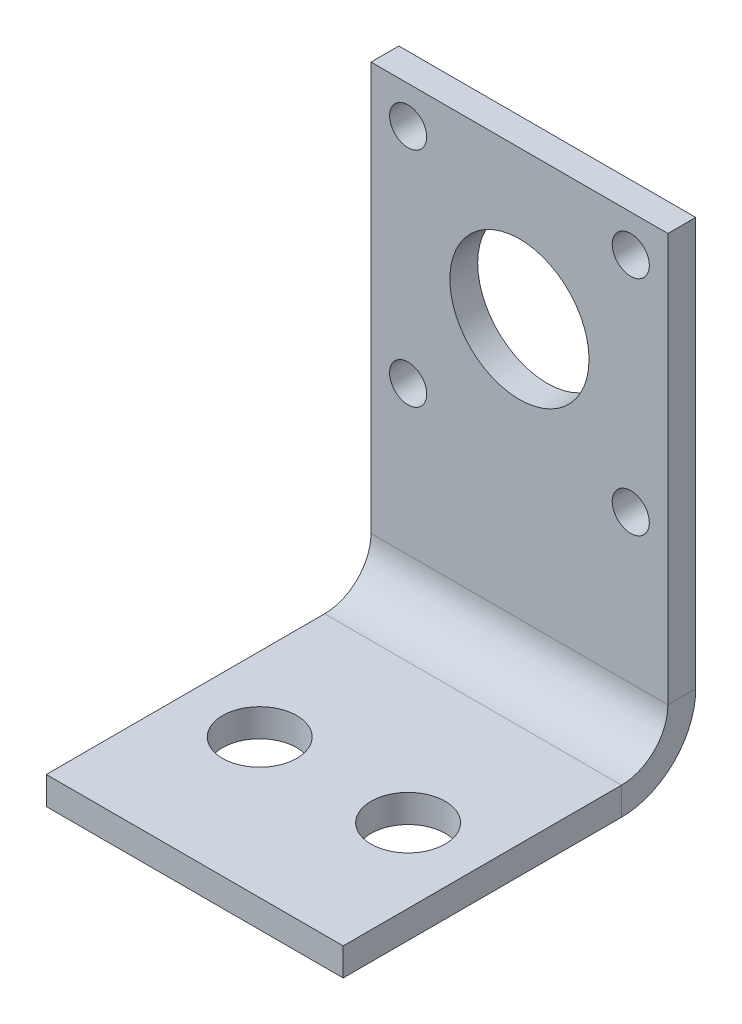
ISO-10303-21;
HEADER;
FILE_DESCRIPTION(('STEP AP214'),'2;1');
FILE_NAME('part.step','',(''),(''),'','','');
FILE_SCHEMA(('AUTOMOTIVE_DESIGN { 1 0 10303 214 1 1 1 1 }'));
ENDSEC;
DATA;
#1=APPLICATION_CONTEXT('core data for automotive mechanical design processes');
#2=APPLICATION_PROTOCOL_DEFINITION('international standard','automotive_design',2000,#1);
#3=PRODUCT_CONTEXT('',#1,'mechanical');
#4=PRODUCT('Part','Part','',(#3));
#5=PRODUCT_RELATED_PRODUCT_CATEGORY('part','',(#4));
#6=PRODUCT_DEFINITION_FORMATION('','',#4);
#7=PRODUCT_DEFINITION_CONTEXT('part definition',#1,'design');
#8=PRODUCT_DEFINITION('design','',#6,#7);
#9=PRODUCT_DEFINITION_SHAPE('','',#8);
#10=(LENGTH_UNIT() NAMED_UNIT(*) SI_UNIT(.MILLI.,.METRE.));
#11=(NAMED_UNIT(*) PLANE_ANGLE_UNIT() SI_UNIT($,.RADIAN.));
#12=(NAMED_UNIT(*) SI_UNIT($,.STERADIAN.) SOLID_ANGLE_UNIT());
#13=UNCERTAINTY_MEASURE_WITH_UNIT(LENGTH_MEASURE(1.E-05),#10,'distance_accuracy_value','');
#14=(GEOMETRIC_REPRESENTATION_CONTEXT(3) GLOBAL_UNCERTAINTY_ASSIGNED_CONTEXT((#13)) GLOBAL_UNIT_ASSIGNED_CONTEXT((#10,
#11,#12)) REPRESENTATION_CONTEXT('',''));
#15=CARTESIAN_POINT('',(0.,0.,0.));
#16=DIRECTION('',(0.,0.,1.));
#17=DIRECTION('',(1.,0.,0.));
#18=AXIS2_PLACEMENT_3D('',#15,#16,#17);
#19=CARTESIAN_POINT('',(16.,3.,15.));
#20=DIRECTION('',(-1.,0.,0.));
#21=DIRECTION('',(0.,0.,1.));
#22=AXIS2_PLACEMENT_3D('',#19,#20,#21);
#23=PLANE('',#22);
#24=DIRECTION('',(0.,0.,-1.));
#25=VECTOR('',#24,1.);
#26=CARTESIAN_POINT('',(16.,0.,15.));
#27=LINE('',#26,#25);
#28=CARTESIAN_POINT('',(16.,0.,15.));
#29=VERTEX_POINT('',#28);
#30=CARTESIAN_POINT('',(16.,0.,-15.));
#31=VERTEX_POINT('',#30);
#32=EDGE_CURVE('E178',#29,#31,#27,.T.);
#33=ORIENTED_EDGE('',*,*,#32,.T.);
#34=DIRECTION('',(0.,-1.,0.));
#35=VECTOR('',#34,1.);
#36=CARTESIAN_POINT('',(16.,3.,-15.));
#37=LINE('',#36,#35);
#38=CARTESIAN_POINT('',(16.,3.,-15.));
#39=VERTEX_POINT('',#38);
#40=EDGE_CURVE('E13',#39,#31,#37,.T.);
#41=ORIENTED_EDGE('',*,*,#40,.F.);
#42=DIRECTION('',(0.,0.,-1.));
#43=VECTOR('',#42,1.);
#44=CARTESIAN_POINT('',(16.,3.,15.));
#45=LINE('',#44,#43);
#46=CARTESIAN_POINT('',(16.,3.,15.));
#47=VERTEX_POINT('',#46);
#48=EDGE_CURVE('E103',#47,#39,#45,.T.);
#49=ORIENTED_EDGE('',*,*,#48,.F.);
#50=DIRECTION('',(0.,-1.,0.));
#51=VECTOR('',#50,1.);
#52=CARTESIAN_POINT('',(16.,3.,15.));
#53=LINE('',#52,#51);
#54=EDGE_CURVE('E194',#47,#29,#53,.T.);
#55=ORIENTED_EDGE('',*,*,#54,.T.);
#56=EDGE_LOOP('',(#33,#41,#49,#55));
#57=FACE_BOUND('',#56,.T.);
#58=ADVANCED_FACE('F59',(#57),#23,.F.);
#59=CARTESIAN_POINT('',(-16.,3.,15.));
#60=DIRECTION('',(1.,0.,0.));
#61=DIRECTION('',(0.,0.,-1.));
#62=AXIS2_PLACEMENT_3D('',#59,#60,#61);
#63=PLANE('',#62);
#64=DIRECTION('',(0.,0.,1.));
#65=VECTOR('',#64,1.);
#66=CARTESIAN_POINT('',(-16.,0.,15.));
#67=LINE('',#66,#65);
#68=CARTESIAN_POINT('',(-16.,0.,-15.));
#69=VERTEX_POINT('',#68);
#70=CARTESIAN_POINT('',(-16.,0.,15.));
#71=VERTEX_POINT('',#70);
#72=EDGE_CURVE('E92',#69,#71,#67,.T.);
#73=ORIENTED_EDGE('',*,*,#72,.T.);
#74=DIRECTION('',(0.,-1.,0.));
#75=VECTOR('',#74,1.);
#76=CARTESIAN_POINT('',(-16.,3.,15.));
#77=LINE('',#76,#75);
#78=CARTESIAN_POINT('',(-16.,3.,15.));
#79=VERTEX_POINT('',#78);
#80=EDGE_CURVE('E203',#79,#71,#77,.T.);
#81=ORIENTED_EDGE('',*,*,#80,.F.);
#82=DIRECTION('',(0.,0.,1.));
#83=VECTOR('',#82,1.);
#84=CARTESIAN_POINT('',(-16.,3.,15.));
#85=LINE('',#84,#83);
#86=CARTESIAN_POINT('',(-16.,3.,-15.));
#87=VERTEX_POINT('',#86);
#88=EDGE_CURVE('E191',#87,#79,#85,.T.);
#89=ORIENTED_EDGE('',*,*,#88,.F.);
#90=DIRECTION('',(0.,-1.,0.));
#91=VECTOR('',#90,1.);
#92=CARTESIAN_POINT('',(-16.,3.,-15.));
#93=LINE('',#92,#91);
#94=EDGE_CURVE('E68',#87,#69,#93,.T.);
#95=ORIENTED_EDGE('',*,*,#94,.T.);
#96=EDGE_LOOP('',(#73,#81,#89,#95));
#97=FACE_BOUND('',#96,.T.);
#98=ADVANCED_FACE('F248',(#97),#63,.F.);
#99=CARTESIAN_POINT('',(-16.,3.,15.));
#100=DIRECTION('',(0.,0.,-1.));
#101=DIRECTION('',(-1.,0.,0.));
#102=AXIS2_PLACEMENT_3D('',#99,#100,#101);
#103=PLANE('',#102);
#104=DIRECTION('',(1.,0.,0.));
#105=VECTOR('',#104,1.);
#106=CARTESIAN_POINT('',(-16.,0.,15.));
#107=LINE('',#106,#105);
#108=EDGE_CURVE('E98',#71,#29,#107,.T.);
#109=ORIENTED_EDGE('',*,*,#108,.T.);
#110=ORIENTED_EDGE('',*,*,#54,.F.);
#111=DIRECTION('',(1.,0.,0.));
#112=VECTOR('',#111,1.);
#113=CARTESIAN_POINT('',(-16.,3.,15.));
#114=LINE('',#113,#112);
#115=EDGE_CURVE('E77',#79,#47,#114,.T.);
#116=ORIENTED_EDGE('',*,*,#115,.F.);
#117=ORIENTED_EDGE('',*,*,#80,.T.);
#118=EDGE_LOOP('',(#109,#110,#116,#117));
#119=FACE_BOUND('',#118,.T.);
#120=ADVANCED_FACE('F253',(#119),#103,.F.);
#121=CARTESIAN_POINT('',(0.,3.,0.));
#122=DIRECTION('',(0.,-1.,0.));
#123=DIRECTION('',(0.,0.,-1.));
#124=AXIS2_PLACEMENT_3D('',#121,#122,#123);
#125=PLANE('',#124);
#126=CARTESIAN_POINT('',(-8.,3.,0.));
#127=DIRECTION('',(0.,1.,0.));
#128=DIRECTION('',(0.,0.,1.));
#129=AXIS2_PLACEMENT_3D('',#126,#127,#128);
#130=CIRCLE('',#129,4.);
#131=CARTESIAN_POINT('',(-8.,3.,4.));
#132=VERTEX_POINT('',#131);
#133=EDGE_CURVE('E207',#132,#132,#130,.T.);
#134=ORIENTED_EDGE('',*,*,#133,.F.);
#135=EDGE_LOOP('',(#134));
#136=FACE_BOUND('',#135,.T.);
#137=CARTESIAN_POINT('',(8.,3.,0.));
#138=DIRECTION('',(0.,1.,0.));
#139=DIRECTION('',(0.,0.,1.));
#140=AXIS2_PLACEMENT_3D('',#137,#138,#139);
#141=CIRCLE('',#140,4.);
#142=CARTESIAN_POINT('',(8.,3.,4.));
#143=VERTEX_POINT('',#142);
#144=EDGE_CURVE('E212',#143,#143,#141,.T.);
#145=ORIENTED_EDGE('',*,*,#144,.F.);
#146=EDGE_LOOP('',(#145));
#147=FACE_BOUND('',#146,.T.);
#148=ORIENTED_EDGE('',*,*,#48,.T.);
#149=DIRECTION('',(-1.,0.,0.));
#150=VECTOR('',#149,1.);
#151=CARTESIAN_POINT('',(-16.,3.,-15.));
#152=LINE('',#151,#150);
#153=EDGE_CURVE('E189',#39,#87,#152,.T.);
#154=ORIENTED_EDGE('',*,*,#153,.T.);
#155=ORIENTED_EDGE('',*,*,#88,.T.);
#156=ORIENTED_EDGE('',*,*,#115,.T.);
#157=EDGE_LOOP('',(#148,#154,#155,#156));
#158=FACE_BOUND('',#157,.T.);
#159=ADVANCED_FACE('F262',(#136,#147,#158),#125,.F.);
#160=CARTESIAN_POINT('',(0.,0.,0.));
#161=DIRECTION('',(0.,-1.,0.));
#162=DIRECTION('',(0.,0.,-1.));
#163=AXIS2_PLACEMENT_3D('',#160,#161,#162);
#164=PLANE('',#163);
#165=CARTESIAN_POINT('',(-8.,0.,0.));
#166=DIRECTION('',(0.,-1.,0.));
#167=DIRECTION('',(0.,0.,-1.));
#168=AXIS2_PLACEMENT_3D('',#165,#166,#167);
#169=CIRCLE('',#168,4.);
#170=CARTESIAN_POINT('',(-8.,0.,-4.));
#171=VERTEX_POINT('',#170);
#172=EDGE_CURVE('E62',#171,#171,#169,.T.);
#173=ORIENTED_EDGE('',*,*,#172,.F.);
#174=EDGE_LOOP('',(#173));
#175=FACE_BOUND('',#174,.T.);
#176=CARTESIAN_POINT('',(8.,0.,0.));
#177=DIRECTION('',(0.,-1.,0.));
#178=DIRECTION('',(0.,0.,-1.));
#179=AXIS2_PLACEMENT_3D('',#176,#177,#178);
#180=CIRCLE('',#179,4.);
#181=CARTESIAN_POINT('',(8.,0.,-4.));
#182=VERTEX_POINT('',#181);
#183=EDGE_CURVE('E205',#182,#182,#180,.T.);
#184=ORIENTED_EDGE('',*,*,#183,.F.);
#185=EDGE_LOOP('',(#184));
#186=FACE_BOUND('',#185,.T.);
#187=ORIENTED_EDGE('',*,*,#32,.F.);
#188=ORIENTED_EDGE('',*,*,#108,.F.);
#189=ORIENTED_EDGE('',*,*,#72,.F.);
#190=DIRECTION('',(-1.,0.,0.));
#191=VECTOR('',#190,1.);
#192=CARTESIAN_POINT('',(-16.,0.,-15.));
#193=LINE('',#192,#191);
#194=EDGE_CURVE('E197',#31,#69,#193,.T.);
#195=ORIENTED_EDGE('',*,*,#194,.F.);
#196=EDGE_LOOP('',(#187,#188,#189,#195));
#197=FACE_BOUND('',#196,.T.);
#198=ADVANCED_FACE('F260',(#175,#186,#197),#164,.T.);
#199=CARTESIAN_POINT('',(16.,7.99999999999995,-15.));
#200=DIRECTION('',(1.,0.,0.));
#201=DIRECTION('',(0.,0.,-1.));
#202=AXIS2_PLACEMENT_3D('',#199,#200,#201);
#203=PLANE('',#202);
#204=DIRECTION('',(0.,0.,1.));
#205=VECTOR('',#204,1.);
#206=CARTESIAN_POINT('',(16.,8.,-22.9999999999999));
#207=LINE('',#206,#205);
#208=CARTESIAN_POINT('',(16.,7.99999999999993,-20.));
#209=VERTEX_POINT('',#208);
#210=CARTESIAN_POINT('',(16.,7.99999999999992,-23.));
#211=VERTEX_POINT('',#210);
#212=EDGE_CURVE('E157',#209,#211,#207,.F.);
#213=ORIENTED_EDGE('',*,*,#212,.F.);
#214=CARTESIAN_POINT('',(16.,7.99999999999995,-15.));
#215=DIRECTION('',(-1.,0.,0.));
#216=DIRECTION('',(0.,0.,1.));
#217=AXIS2_PLACEMENT_3D('',#214,#215,#216);
#218=CIRCLE('',#217,5.);
#219=EDGE_CURVE('E182',#39,#209,#218,.F.);
#220=ORIENTED_EDGE('',*,*,#219,.F.);
#221=ORIENTED_EDGE('',*,*,#40,.T.);
#222=CARTESIAN_POINT('',(16.,7.99999999999995,-15.));
#223=DIRECTION('',(-1.,0.,0.));
#224=DIRECTION('',(0.,0.,1.));
#225=AXIS2_PLACEMENT_3D('',#222,#223,#224);
#226=CIRCLE('',#225,8.);
#227=EDGE_CURVE('E175',#31,#211,#226,.F.);
#228=ORIENTED_EDGE('',*,*,#227,.T.);
#229=EDGE_LOOP('',(#213,#220,#221,#228));
#230=FACE_BOUND('',#229,.T.);
#231=ADVANCED_FACE('F258',(#230),#203,.T.);
#232=CARTESIAN_POINT('',(-16.,7.99999999999995,-15.));
#233=DIRECTION('',(1.,0.,0.));
#234=DIRECTION('',(0.,0.,-1.));
#235=AXIS2_PLACEMENT_3D('',#232,#233,#234);
#236=PLANE('',#235);
#237=CARTESIAN_POINT('',(-16.,7.99999999999995,-15.));
#238=DIRECTION('',(-1.,0.,0.));
#239=DIRECTION('',(0.,0.,1.));
#240=AXIS2_PLACEMENT_3D('',#237,#238,#239);
#241=CIRCLE('',#240,5.);
#242=CARTESIAN_POINT('',(-16.,7.99999999999993,-20.));
#243=VERTEX_POINT('',#242);
#244=EDGE_CURVE('E185',#243,#87,#241,.T.);
#245=ORIENTED_EDGE('',*,*,#244,.F.);
#246=DIRECTION('',(0.,0.,1.));
#247=VECTOR('',#246,1.);
#248=CARTESIAN_POINT('',(-16.,7.99999999999998,-20.));
#249=LINE('',#248,#247);
#250=CARTESIAN_POINT('',(-16.,8.,-23.));
#251=VERTEX_POINT('',#250);
#252=EDGE_CURVE('E169',#243,#251,#249,.F.);
#253=ORIENTED_EDGE('',*,*,#252,.T.);
#254=CARTESIAN_POINT('',(-16.,7.99999999999995,-15.));
#255=DIRECTION('',(-1.,0.,0.));
#256=DIRECTION('',(0.,0.,1.));
#257=AXIS2_PLACEMENT_3D('',#254,#255,#256);
#258=CIRCLE('',#257,8.);
#259=EDGE_CURVE('E179',#251,#69,#258,.T.);
#260=ORIENTED_EDGE('',*,*,#259,.T.);
#261=ORIENTED_EDGE('',*,*,#94,.F.);
#262=EDGE_LOOP('',(#245,#253,#260,#261));
#263=FACE_BOUND('',#262,.T.);
#264=ADVANCED_FACE('F234',(#263),#236,.F.);
#265=CARTESIAN_POINT('',(-16.,7.99999999999995,-15.));
#266=DIRECTION('',(-1.,0.,0.));
#267=DIRECTION('',(0.,0.,-1.));
#268=AXIS2_PLACEMENT_3D('',#265,#266,#267);
#269=CYLINDRICAL_SURFACE('',#268,8.);
#270=ORIENTED_EDGE('',*,*,#194,.T.);
#271=ORIENTED_EDGE('',*,*,#259,.F.);
#272=DIRECTION('',(-1.,0.,0.));
#273=VECTOR('',#272,1.);
#274=CARTESIAN_POINT('',(16.,8.,-23.));
#275=LINE('',#274,#273);
#276=EDGE_CURVE('E167',#251,#211,#275,.F.);
#277=ORIENTED_EDGE('',*,*,#276,.T.);
#278=ORIENTED_EDGE('',*,*,#227,.F.);
#279=EDGE_LOOP('',(#270,#271,#277,#278));
#280=FACE_BOUND('',#279,.T.);
#281=ADVANCED_FACE('F243',(#280),#269,.T.);
#282=CARTESIAN_POINT('',(-16.,7.99999999999995,-15.));
#283=DIRECTION('',(-1.,0.,0.));
#284=DIRECTION('',(0.,0.,-1.));
#285=AXIS2_PLACEMENT_3D('',#282,#283,#284);
#286=CYLINDRICAL_SURFACE('',#285,5.);
#287=ORIENTED_EDGE('',*,*,#153,.F.);
#288=ORIENTED_EDGE('',*,*,#219,.T.);
#289=DIRECTION('',(-1.,0.,0.));
#290=VECTOR('',#289,1.);
#291=CARTESIAN_POINT('',(16.,7.99999999999998,-20.));
#292=LINE('',#291,#290);
#293=EDGE_CURVE('E172',#209,#243,#292,.T.);
#294=ORIENTED_EDGE('',*,*,#293,.T.);
#295=ORIENTED_EDGE('',*,*,#244,.T.);
#296=EDGE_LOOP('',(#287,#288,#294,#295));
#297=FACE_BOUND('',#296,.T.);
#298=ADVANCED_FACE('F229',(#297),#286,.F.);
#299=CARTESIAN_POINT('',(-16.,52.,-23.0000000000002));
#300=DIRECTION('',(1.,0.,0.));
#301=DIRECTION('',(0.,0.,-1.));
#302=AXIS2_PLACEMENT_3D('',#299,#300,#301);
#303=PLANE('',#302);
#304=ORIENTED_EDGE('',*,*,#252,.F.);
#305=DIRECTION('',(0.,-1.,0.));
#306=VECTOR('',#305,1.);
#307=CARTESIAN_POINT('',(-16.,52.,-20.0000000000002));
#308=LINE('',#307,#306);
#309=CARTESIAN_POINT('',(-16.,52.,-20.0000000000002));
#310=VERTEX_POINT('',#309);
#311=EDGE_CURVE('E165',#243,#310,#308,.F.);
#312=ORIENTED_EDGE('',*,*,#311,.T.);
#313=DIRECTION('',(0.,0.,1.));
#314=VECTOR('',#313,1.);
#315=CARTESIAN_POINT('',(-16.,52.,-23.0000000000002));
#316=LINE('',#315,#314);
#317=CARTESIAN_POINT('',(-16.,52.,-23.0000000000002));
#318=VERTEX_POINT('',#317);
#319=EDGE_CURVE('E153',#318,#310,#316,.T.);
#320=ORIENTED_EDGE('',*,*,#319,.F.);
#321=DIRECTION('',(0.,1.,0.));
#322=VECTOR('',#321,1.);
#323=CARTESIAN_POINT('',(-16.,0.,-23.));
#324=LINE('',#323,#322);
#325=EDGE_CURVE('E140',#251,#318,#324,.T.);
#326=ORIENTED_EDGE('',*,*,#325,.F.);
#327=EDGE_LOOP('',(#304,#312,#320,#326));
#328=FACE_BOUND('',#327,.T.);
#329=ADVANCED_FACE('F235',(#328),#303,.F.);
#330=CARTESIAN_POINT('',(16.,2.99999999999999,-23.));
#331=DIRECTION('',(-1.,0.,0.));
#332=DIRECTION('',(0.,0.,1.));
#333=AXIS2_PLACEMENT_3D('',#330,#331,#332);
#334=PLANE('',#333);
#335=ORIENTED_EDGE('',*,*,#212,.T.);
#336=DIRECTION('',(0.,-1.,0.));
#337=VECTOR('',#336,1.);
#338=CARTESIAN_POINT('',(16.,0.,-23.));
#339=LINE('',#338,#337);
#340=CARTESIAN_POINT('',(16.,52.,-23.0000000000002));
#341=VERTEX_POINT('',#340);
#342=EDGE_CURVE('E138',#341,#211,#339,.T.);
#343=ORIENTED_EDGE('',*,*,#342,.F.);
#344=DIRECTION('',(0.,0.,1.));
#345=VECTOR('',#344,1.);
#346=CARTESIAN_POINT('',(16.,52.,-23.0000000000002));
#347=LINE('',#346,#345);
#348=CARTESIAN_POINT('',(16.,52.,-20.0000000000002));
#349=VERTEX_POINT('',#348);
#350=EDGE_CURVE('E146',#341,#349,#347,.T.);
#351=ORIENTED_EDGE('',*,*,#350,.T.);
#352=DIRECTION('',(0.,1.,0.));
#353=VECTOR('',#352,1.);
#354=CARTESIAN_POINT('',(16.,3.,-20.));
#355=LINE('',#354,#353);
#356=EDGE_CURVE('E162',#349,#209,#355,.F.);
#357=ORIENTED_EDGE('',*,*,#356,.T.);
#358=EDGE_LOOP('',(#335,#343,#351,#357));
#359=FACE_BOUND('',#358,.T.);
#360=ADVANCED_FACE('F156',(#359),#334,.F.);
#361=CARTESIAN_POINT('',(0.,0.,-23.));
#362=DIRECTION('',(0.,0.,1.));
#363=DIRECTION('',(0.,-1.,0.));
#364=AXIS2_PLACEMENT_3D('',#361,#362,#363);
#365=PLANE('',#364);
#366=CARTESIAN_POINT('',(-12.,24.,-23.0000000000001));
#367=DIRECTION('',(0.,0.,1.));
#368=DIRECTION('',(0.,-1.,0.));
#369=AXIS2_PLACEMENT_3D('',#366,#367,#368);
#370=CIRCLE('',#369,2.);
#371=CARTESIAN_POINT('',(-12.,22.,-23.));
#372=VERTEX_POINT('',#371);
#373=EDGE_CURVE('E217',#372,#372,#370,.T.);
#374=ORIENTED_EDGE('',*,*,#373,.T.);
#375=EDGE_LOOP('',(#374));
#376=FACE_BOUND('',#375,.T.);
#377=CARTESIAN_POINT('',(12.,24.,-23.0000000000001));
#378=DIRECTION('',(0.,0.,1.));
#379=DIRECTION('',(0.,-1.,0.));
#380=AXIS2_PLACEMENT_3D('',#377,#378,#379);
#381=CIRCLE('',#380,2.);
#382=CARTESIAN_POINT('',(12.,22.,-23.));
#383=VERTEX_POINT('',#382);
#384=EDGE_CURVE('E481',#383,#383,#381,.T.);
#385=ORIENTED_EDGE('',*,*,#384,.T.);
#386=EDGE_LOOP('',(#385));
#387=FACE_BOUND('',#386,.T.);
#388=CARTESIAN_POINT('',(12.,48.,-23.0000000000001));
#389=DIRECTION('',(0.,0.,1.));
#390=DIRECTION('',(0.,-1.,0.));
#391=AXIS2_PLACEMENT_3D('',#388,#389,#390);
#392=CIRCLE('',#391,2.);
#393=CARTESIAN_POINT('',(12.,46.,-23.0000000000001));
#394=VERTEX_POINT('',#393);
#395=EDGE_CURVE('E483',#394,#394,#392,.T.);
#396=ORIENTED_EDGE('',*,*,#395,.T.);
#397=EDGE_LOOP('',(#396));
#398=FACE_BOUND('',#397,.T.);
#399=CARTESIAN_POINT('',(-12.,48.,-23.0000000000001));
#400=DIRECTION('',(0.,0.,1.));
#401=DIRECTION('',(0.,-1.,0.));
#402=AXIS2_PLACEMENT_3D('',#399,#400,#401);
#403=CIRCLE('',#402,2.);
#404=CARTESIAN_POINT('',(-12.,46.,-23.0000000000001));
#405=VERTEX_POINT('',#404);
#406=EDGE_CURVE('E487',#405,#405,#403,.T.);
#407=ORIENTED_EDGE('',*,*,#406,.T.);
#408=EDGE_LOOP('',(#407));
#409=FACE_BOUND('',#408,.T.);
#410=CARTESIAN_POINT('',(0.,36.,-23.0000000000001));
#411=DIRECTION('',(0.,0.,1.));
#412=DIRECTION('',(0.,-1.,0.));
#413=AXIS2_PLACEMENT_3D('',#410,#411,#412);
#414=CIRCLE('',#413,7.5);
#415=CARTESIAN_POINT('',(0.,28.5,-23.0000000000001));
#416=VERTEX_POINT('',#415);
#417=EDGE_CURVE('E492',#416,#416,#414,.T.);
#418=ORIENTED_EDGE('',*,*,#417,.T.);
#419=EDGE_LOOP('',(#418));
#420=FACE_BOUND('',#419,.T.);
#421=ORIENTED_EDGE('',*,*,#276,.F.);
#422=ORIENTED_EDGE('',*,*,#325,.T.);
#423=DIRECTION('',(1.,0.,0.));
#424=VECTOR('',#423,1.);
#425=CARTESIAN_POINT('',(0.,52.,-23.0000000000002));
#426=LINE('',#425,#424);
#427=EDGE_CURVE('E133',#318,#341,#426,.T.);
#428=ORIENTED_EDGE('',*,*,#427,.T.);
#429=ORIENTED_EDGE('',*,*,#342,.T.);
#430=EDGE_LOOP('',(#421,#422,#428,#429));
#431=FACE_BOUND('',#430,.T.);
#432=ADVANCED_FACE('F136',(#376,#387,#398,#409,#420,#431),#365,.F.);
#433=CARTESIAN_POINT('',(0.,0.,-20.));
#434=DIRECTION('',(0.,0.,1.));
#435=DIRECTION('',(0.,-1.,0.));
#436=AXIS2_PLACEMENT_3D('',#433,#434,#435);
#437=PLANE('',#436);
#438=CARTESIAN_POINT('',(-12.,24.,-20.));
#439=DIRECTION('',(0.,0.,1.));
#440=DIRECTION('',(-1.,0.,0.));
#441=AXIS2_PLACEMENT_3D('',#438,#439,#440);
#442=CIRCLE('',#441,2.);
#443=CARTESIAN_POINT('',(-14.,24.,-20.));
#444=VERTEX_POINT('',#443);
#445=EDGE_CURVE('E478',#444,#444,#442,.T.);
#446=ORIENTED_EDGE('',*,*,#445,.F.);
#447=EDGE_LOOP('',(#446));
#448=FACE_BOUND('',#447,.T.);
#449=CARTESIAN_POINT('',(12.,24.,-20.));
#450=DIRECTION('',(0.,0.,1.));
#451=DIRECTION('',(1.,0.,0.));
#452=AXIS2_PLACEMENT_3D('',#449,#450,#451);
#453=CIRCLE('',#452,2.);
#454=CARTESIAN_POINT('',(14.,24.,-20.));
#455=VERTEX_POINT('',#454);
#456=EDGE_CURVE('E500',#455,#455,#453,.T.);
#457=ORIENTED_EDGE('',*,*,#456,.F.);
#458=EDGE_LOOP('',(#457));
#459=FACE_BOUND('',#458,.T.);
#460=CARTESIAN_POINT('',(12.,48.,-20.));
#461=DIRECTION('',(0.,0.,1.));
#462=DIRECTION('',(-1.,0.,0.));
#463=AXIS2_PLACEMENT_3D('',#460,#461,#462);
#464=CIRCLE('',#463,2.);
#465=CARTESIAN_POINT('',(10.,48.,-20.));
#466=VERTEX_POINT('',#465);
#467=EDGE_CURVE('E503',#466,#466,#464,.T.);
#468=ORIENTED_EDGE('',*,*,#467,.F.);
#469=EDGE_LOOP('',(#468));
#470=FACE_BOUND('',#469,.T.);
#471=CARTESIAN_POINT('',(-12.,48.,-20.));
#472=DIRECTION('',(0.,0.,1.));
#473=DIRECTION('',(1.,0.,0.));
#474=AXIS2_PLACEMENT_3D('',#471,#472,#473);
#475=CIRCLE('',#474,2.);
#476=CARTESIAN_POINT('',(-10.,48.,-20.));
#477=VERTEX_POINT('',#476);
#478=EDGE_CURVE('E498',#477,#477,#475,.T.);
#479=ORIENTED_EDGE('',*,*,#478,.F.);
#480=EDGE_LOOP('',(#479));
#481=FACE_BOUND('',#480,.T.);
#482=CARTESIAN_POINT('',(0.,36.,-20.));
#483=DIRECTION('',(0.,0.,1.));
#484=DIRECTION('',(1.,0.,0.));
#485=AXIS2_PLACEMENT_3D('',#482,#483,#484);
#486=CIRCLE('',#485,7.5);
#487=CARTESIAN_POINT('',(7.5,36.,-20.));
#488=VERTEX_POINT('',#487);
#489=EDGE_CURVE('E495',#488,#488,#486,.T.);
#490=ORIENTED_EDGE('',*,*,#489,.F.);
#491=EDGE_LOOP('',(#490));
#492=FACE_BOUND('',#491,.T.);
#493=ORIENTED_EDGE('',*,*,#311,.F.);
#494=ORIENTED_EDGE('',*,*,#293,.F.);
#495=ORIENTED_EDGE('',*,*,#356,.F.);
#496=DIRECTION('',(-1.,0.,0.));
#497=VECTOR('',#496,1.);
#498=CARTESIAN_POINT('',(16.,52.,-20.0000000000002));
#499=LINE('',#498,#497);
#500=EDGE_CURVE('E149',#310,#349,#499,.F.);
#501=ORIENTED_EDGE('',*,*,#500,.F.);
#502=EDGE_LOOP('',(#493,#494,#495,#501));
#503=FACE_BOUND('',#502,.T.);
#504=ADVANCED_FACE('F224',(#448,#459,#470,#481,#492,#503),#437,.T.);
#505=CARTESIAN_POINT('',(16.,52.,-23.0000000000002));
#506=DIRECTION('',(0.,-1.,0.));
#507=DIRECTION('',(0.,0.,-1.));
#508=AXIS2_PLACEMENT_3D('',#505,#506,#507);
#509=PLANE('',#508);
#510=ORIENTED_EDGE('',*,*,#500,.T.);
#511=ORIENTED_EDGE('',*,*,#350,.F.);
#512=ORIENTED_EDGE('',*,*,#427,.F.);
#513=ORIENTED_EDGE('',*,*,#319,.T.);
#514=EDGE_LOOP('',(#510,#511,#512,#513));
#515=FACE_BOUND('',#514,.T.);
#516=ADVANCED_FACE('F147',(#515),#509,.F.);
#517=CARTESIAN_POINT('',(8.,-7.,0.));
#518=DIRECTION('',(0.,1.,0.));
#519=DIRECTION('',(0.,0.,1.));
#520=AXIS2_PLACEMENT_3D('',#517,#518,#519);
#521=CYLINDRICAL_SURFACE('',#520,4.);
#522=ORIENTED_EDGE('',*,*,#183,.T.);
#523=EDGE_LOOP('',(#522));
#524=FACE_BOUND('',#523,.T.);
#525=ORIENTED_EDGE('',*,*,#144,.T.);
#526=EDGE_LOOP('',(#525));
#527=FACE_BOUND('',#526,.T.);
#528=ADVANCED_FACE('F310',(#524,#527),#521,.F.);
#529=CARTESIAN_POINT('',(-8.,-7.,0.));
#530=DIRECTION('',(0.,1.,0.));
#531=DIRECTION('',(0.,0.,1.));
#532=AXIS2_PLACEMENT_3D('',#529,#530,#531);
#533=CYLINDRICAL_SURFACE('',#532,4.);
#534=ORIENTED_EDGE('',*,*,#172,.T.);
#535=EDGE_LOOP('',(#534));
#536=FACE_BOUND('',#535,.T.);
#537=ORIENTED_EDGE('',*,*,#133,.T.);
#538=EDGE_LOOP('',(#537));
#539=FACE_BOUND('',#538,.T.);
#540=ADVANCED_FACE('F336',(#536,#539),#533,.F.);
#541=CARTESIAN_POINT('',(0.,36.,-30.));
#542=DIRECTION('',(0.,0.,1.));
#543=DIRECTION('',(1.,0.,0.));
#544=AXIS2_PLACEMENT_3D('',#541,#542,#543);
#545=CYLINDRICAL_SURFACE('',#544,7.5);
#546=ORIENTED_EDGE('',*,*,#489,.T.);
#547=EDGE_LOOP('',(#546));
#548=FACE_BOUND('',#547,.T.);
#549=ORIENTED_EDGE('',*,*,#417,.F.);
#550=EDGE_LOOP('',(#549));
#551=FACE_BOUND('',#550,.T.);
#552=ADVANCED_FACE('F346',(#548,#551),#545,.F.);
#553=CARTESIAN_POINT('',(-12.,48.,-30.));
#554=DIRECTION('',(0.,0.,1.));
#555=DIRECTION('',(1.,0.,0.));
#556=AXIS2_PLACEMENT_3D('',#553,#554,#555);
#557=CYLINDRICAL_SURFACE('',#556,2.);
#558=ORIENTED_EDGE('',*,*,#478,.T.);
#559=EDGE_LOOP('',(#558));
#560=FACE_BOUND('',#559,.T.);
#561=ORIENTED_EDGE('',*,*,#406,.F.);
#562=EDGE_LOOP('',(#561));
#563=FACE_BOUND('',#562,.T.);
#564=ADVANCED_FACE('F373',(#560,#563),#557,.F.);
#565=CARTESIAN_POINT('',(12.,48.,-30.));
#566=DIRECTION('',(0.,0.,1.));
#567=DIRECTION('',(1.,0.,0.));
#568=AXIS2_PLACEMENT_3D('',#565,#566,#567);
#569=CYLINDRICAL_SURFACE('',#568,2.);
#570=ORIENTED_EDGE('',*,*,#467,.T.);
#571=EDGE_LOOP('',(#570));
#572=FACE_BOUND('',#571,.T.);
#573=ORIENTED_EDGE('',*,*,#395,.F.);
#574=EDGE_LOOP('',(#573));
#575=FACE_BOUND('',#574,.T.);
#576=ADVANCED_FACE('F384',(#572,#575),#569,.F.);
#577=CARTESIAN_POINT('',(12.,24.,-30.));
#578=DIRECTION('',(0.,0.,1.));
#579=DIRECTION('',(1.,0.,0.));
#580=AXIS2_PLACEMENT_3D('',#577,#578,#579);
#581=CYLINDRICAL_SURFACE('',#580,2.);
#582=ORIENTED_EDGE('',*,*,#456,.T.);
#583=EDGE_LOOP('',(#582));
#584=FACE_BOUND('',#583,.T.);
#585=ORIENTED_EDGE('',*,*,#384,.F.);
#586=EDGE_LOOP('',(#585));
#587=FACE_BOUND('',#586,.T.);
#588=ADVANCED_FACE('F395',(#584,#587),#581,.F.);
#589=CARTESIAN_POINT('',(-12.,24.,-30.));
#590=DIRECTION('',(0.,0.,1.));
#591=DIRECTION('',(1.,0.,0.));
#592=AXIS2_PLACEMENT_3D('',#589,#590,#591);
#593=CYLINDRICAL_SURFACE('',#592,2.);
#594=ORIENTED_EDGE('',*,*,#445,.T.);
#595=EDGE_LOOP('',(#594));
#596=FACE_BOUND('',#595,.T.);
#597=ORIENTED_EDGE('',*,*,#373,.F.);
#598=EDGE_LOOP('',(#597));
#599=FACE_BOUND('',#598,.T.);
#600=ADVANCED_FACE('F406',(#596,#599),#593,.F.);
#601=CLOSED_SHELL('',(#58,#98,#120,#159,#198,#231,#264,#281,#298,#329,#360,#432,#504,#516,#528,
#540,#552,#564,#576,#588,#600));
#602=MANIFOLD_SOLID_BREP('B2',#601);
#603=ADVANCED_BREP_SHAPE_REPRESENTATION('',(#18,#602),#14);
#604=SHAPE_DEFINITION_REPRESENTATION(#9,#603);
ENDSEC;
END-ISO-10303-21;
